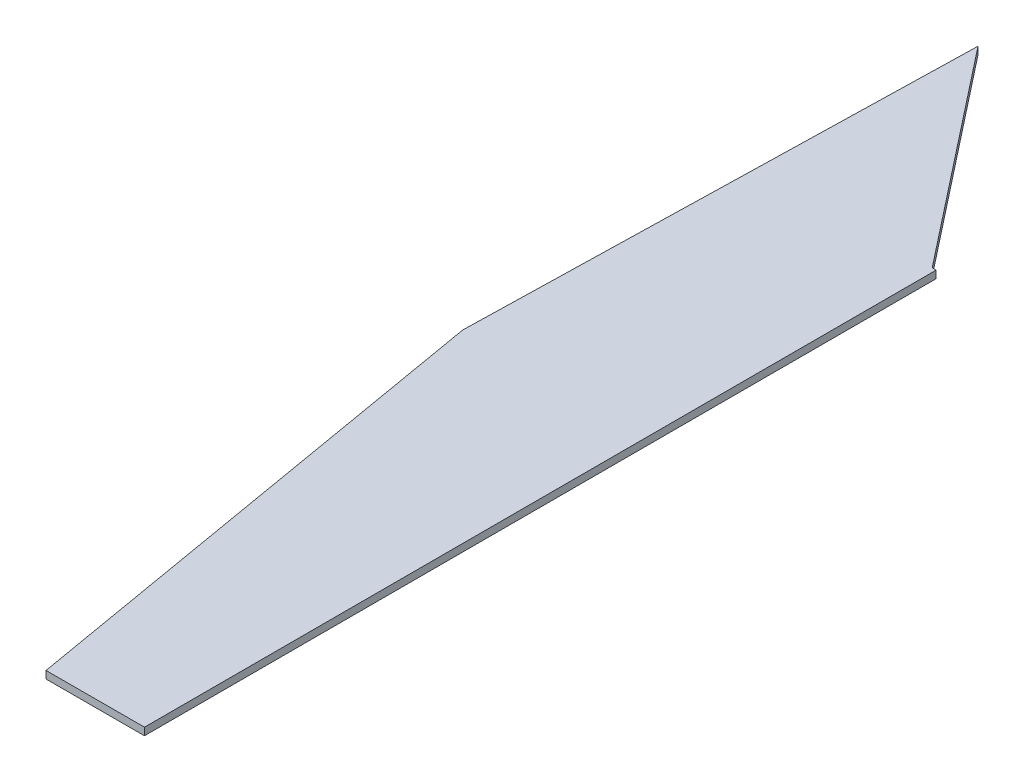
ISO-10303-21;
HEADER;
FILE_DESCRIPTION(('STEP AP214'),'2;1');
FILE_NAME('part.step','',(''),(''),'','','');
FILE_SCHEMA(('AUTOMOTIVE_DESIGN { 1 0 10303 214 1 1 1 1 }'));
ENDSEC;
DATA;
#1=APPLICATION_CONTEXT('core data for automotive mechanical design processes');
#2=APPLICATION_PROTOCOL_DEFINITION('international standard','automotive_design',2000,#1);
#3=PRODUCT_CONTEXT('',#1,'mechanical');
#4=PRODUCT('Part','Part','',(#3));
#5=PRODUCT_RELATED_PRODUCT_CATEGORY('part','',(#4));
#6=PRODUCT_DEFINITION_FORMATION('','',#4);
#7=PRODUCT_DEFINITION_CONTEXT('part definition',#1,'design');
#8=PRODUCT_DEFINITION('design','',#6,#7);
#9=PRODUCT_DEFINITION_SHAPE('','',#8);
#10=(LENGTH_UNIT() NAMED_UNIT(*) SI_UNIT(.MILLI.,.METRE.));
#11=(NAMED_UNIT(*) PLANE_ANGLE_UNIT() SI_UNIT($,.RADIAN.));
#12=(NAMED_UNIT(*) SI_UNIT($,.STERADIAN.) SOLID_ANGLE_UNIT());
#13=UNCERTAINTY_MEASURE_WITH_UNIT(LENGTH_MEASURE(1.E-05),#10,'distance_accuracy_value','');
#14=(GEOMETRIC_REPRESENTATION_CONTEXT(3) GLOBAL_UNCERTAINTY_ASSIGNED_CONTEXT((#13)) GLOBAL_UNIT_ASSIGNED_CONTEXT((#10,
#11,#12)) REPRESENTATION_CONTEXT('',''));
#15=CARTESIAN_POINT('',(0.,0.,0.));
#16=DIRECTION('',(0.,0.,1.));
#17=DIRECTION('',(1.,0.,0.));
#18=AXIS2_PLACEMENT_3D('',#15,#16,#17);
#19=CARTESIAN_POINT('',(-19.9944175208659,2.,-269.792172247349));
#20=DIRECTION('',(0.999721648592657,0.,0.0235929085782034));
#21=DIRECTION('',(0.0235929085782034,0.,-0.999721648592657));
#22=AXIS2_PLACEMENT_3D('',#19,#20,#21);
#23=PLANE('',#22);
#24=DIRECTION('',(-0.0235929085782034,0.,0.999721648592657));
#25=VECTOR('',#24,1.);
#26=CARTESIAN_POINT('',(-19.9944175208659,0.,-269.792172247349));
#27=LINE('',#26,#25);
#28=CARTESIAN_POINT('',(-19.9944175208659,0.,-269.792172247349));
#29=VERTEX_POINT('',#28);
#30=CARTESIAN_POINT('',(-23.1782743286374,0.,-134.879998693264));
#31=VERTEX_POINT('',#30);
#32=EDGE_CURVE('E128',#29,#31,#27,.T.);
#33=ORIENTED_EDGE('',*,*,#32,.T.);
#34=DIRECTION('',(0.,-1.,0.));
#35=VECTOR('',#34,1.);
#36=CARTESIAN_POINT('',(-23.1782743286374,2.,-134.879998693264));
#37=LINE('',#36,#35);
#38=CARTESIAN_POINT('',(-23.1782743286374,2.,-134.879998693264));
#39=VERTEX_POINT('',#38);
#40=EDGE_CURVE('E11',#39,#31,#37,.T.);
#41=ORIENTED_EDGE('',*,*,#40,.F.);
#42=DIRECTION('',(-0.0235929085782034,0.,0.999721648592657));
#43=VECTOR('',#42,1.);
#44=CARTESIAN_POINT('',(-19.9944175208659,2.,-269.792172247349));
#45=LINE('',#44,#43);
#46=CARTESIAN_POINT('',(-19.9944175208659,2.,-269.792172247349));
#47=VERTEX_POINT('',#46);
#48=EDGE_CURVE('E144',#47,#39,#45,.T.);
#49=ORIENTED_EDGE('',*,*,#48,.F.);
#50=DIRECTION('',(0.,-1.,0.));
#51=VECTOR('',#50,1.);
#52=CARTESIAN_POINT('',(-19.9944175208659,2.,-269.792172247349));
#53=LINE('',#52,#51);
#54=EDGE_CURVE('E124',#47,#29,#53,.T.);
#55=ORIENTED_EDGE('',*,*,#54,.T.);
#56=EDGE_LOOP('',(#33,#41,#49,#55));
#57=FACE_BOUND('',#56,.T.);
#58=ADVANCED_FACE('F39',(#57),#23,.F.);
#59=CARTESIAN_POINT('',(-23.1782743286374,2.,-134.879998693264));
#60=DIRECTION('',(0.985554044661549,0.,-0.169361226528572));
#61=DIRECTION('',(-0.169361226528572,0.,-0.985554044661549));
#62=AXIS2_PLACEMENT_3D('',#59,#60,#61);
#63=PLANE('',#62);
#64=DIRECTION('',(0.169361226528572,0.,0.985554044661549));
#65=VECTOR('',#64,1.);
#66=CARTESIAN_POINT('',(-23.1782743286374,0.,-134.879998693264));
#67=LINE('',#66,#65);
#68=CARTESIAN_POINT('',(0.,0.,0.));
#69=VERTEX_POINT('',#68);
#70=EDGE_CURVE('E132',#31,#69,#67,.T.);
#71=ORIENTED_EDGE('',*,*,#70,.T.);
#72=DIRECTION('',(0.,-1.,0.));
#73=VECTOR('',#72,1.);
#74=CARTESIAN_POINT('',(0.,2.,0.));
#75=LINE('',#74,#73);
#76=CARTESIAN_POINT('',(0.,2.,0.));
#77=VERTEX_POINT('',#76);
#78=EDGE_CURVE('E48',#77,#69,#75,.T.);
#79=ORIENTED_EDGE('',*,*,#78,.F.);
#80=DIRECTION('',(0.169361226528572,0.,0.985554044661549));
#81=VECTOR('',#80,1.);
#82=CARTESIAN_POINT('',(-23.1782743286374,2.,-134.879998693264));
#83=LINE('',#82,#81);
#84=EDGE_CURVE('E93',#39,#77,#83,.T.);
#85=ORIENTED_EDGE('',*,*,#84,.F.);
#86=ORIENTED_EDGE('',*,*,#40,.T.);
#87=EDGE_LOOP('',(#71,#79,#85,#86));
#88=FACE_BOUND('',#87,.T.);
#89=ADVANCED_FACE('F172',(#88),#63,.F.);
#90=CARTESIAN_POINT('',(0.,2.,0.));
#91=DIRECTION('',(-0.001220494530022,0.,-0.999999255196274));
#92=DIRECTION('',(-0.999999255196274,0.,0.001220494530022));
#93=AXIS2_PLACEMENT_3D('',#90,#91,#92);
#94=PLANE('',#93);
#95=DIRECTION('',(0.999999255196274,0.,-0.001220494530022));
#96=VECTOR('',#95,1.);
#97=CARTESIAN_POINT('',(0.,0.,0.));
#98=LINE('',#97,#96);
#99=CARTESIAN_POINT('',(26.3621311364079,0.,-0.0321748608156647));
#100=VERTEX_POINT('',#99);
#101=EDGE_CURVE('E135',#69,#100,#98,.T.);
#102=ORIENTED_EDGE('',*,*,#101,.T.);
#103=DIRECTION('',(0.,-1.,0.));
#104=VECTOR('',#103,1.);
#105=CARTESIAN_POINT('',(26.3621311364079,2.,-0.0321748608156647));
#106=LINE('',#105,#104);
#107=CARTESIAN_POINT('',(26.3621311364079,2.,-0.0321748608156647));
#108=VERTEX_POINT('',#107);
#109=EDGE_CURVE('E117',#108,#100,#106,.T.);
#110=ORIENTED_EDGE('',*,*,#109,.F.);
#111=DIRECTION('',(0.999999255196274,0.,-0.001220494530022));
#112=VECTOR('',#111,1.);
#113=CARTESIAN_POINT('',(0.,2.,0.));
#114=LINE('',#113,#112);
#115=EDGE_CURVE('E106',#77,#108,#114,.T.);
#116=ORIENTED_EDGE('',*,*,#115,.F.);
#117=ORIENTED_EDGE('',*,*,#78,.T.);
#118=EDGE_LOOP('',(#102,#110,#116,#117));
#119=FACE_BOUND('',#118,.T.);
#120=ADVANCED_FACE('F154',(#119),#94,.F.);
#121=CARTESIAN_POINT('',(26.3621311364079,2.,-0.0321748608156647));
#122=DIRECTION('',(-1.,0.,0.));
#123=DIRECTION('',(0.,0.,1.));
#124=AXIS2_PLACEMENT_3D('',#121,#122,#123);
#125=PLANE('',#124);
#126=DIRECTION('',(0.,0.,-1.));
#127=VECTOR('',#126,1.);
#128=CARTESIAN_POINT('',(26.3621311364079,0.,-0.0321748608156647));
#129=LINE('',#128,#127);
#130=CARTESIAN_POINT('',(26.3621311364079,0.,-212.216124508445));
#131=VERTEX_POINT('',#130);
#132=EDGE_CURVE('E115',#100,#131,#129,.T.);
#133=ORIENTED_EDGE('',*,*,#132,.T.);
#134=DIRECTION('',(0.,-1.,0.));
#135=VECTOR('',#134,1.);
#136=CARTESIAN_POINT('',(26.3621311364079,2.,-212.216124508445));
#137=LINE('',#136,#135);
#138=CARTESIAN_POINT('',(26.3621311364079,2.,-212.216124508445));
#139=VERTEX_POINT('',#138);
#140=EDGE_CURVE('E112',#139,#131,#137,.T.);
#141=ORIENTED_EDGE('',*,*,#140,.F.);
#142=DIRECTION('',(0.,0.,-1.));
#143=VECTOR('',#142,1.);
#144=CARTESIAN_POINT('',(26.3621311364079,2.,-0.0321748608156647));
#145=LINE('',#144,#143);
#146=EDGE_CURVE('E100',#108,#139,#145,.T.);
#147=ORIENTED_EDGE('',*,*,#146,.F.);
#148=ORIENTED_EDGE('',*,*,#109,.T.);
#149=EDGE_LOOP('',(#133,#141,#147,#148));
#150=FACE_BOUND('',#149,.T.);
#151=ADVANCED_FACE('F113',(#150),#125,.F.);
#152=CARTESIAN_POINT('',(26.3621311364079,2.,-212.216124508445));
#153=DIRECTION('',(-0.0235929085781299,0.,0.999721648592659));
#154=DIRECTION('',(0.999721648592659,0.,0.0235929085781299));
#155=AXIS2_PLACEMENT_3D('',#152,#153,#154);
#156=PLANE('',#155);
#157=DIRECTION('',(-0.999721648592659,0.,-0.0235929085781299));
#158=VECTOR('',#157,1.);
#159=CARTESIAN_POINT('',(26.3621311364079,0.,-212.216124508445));
#160=LINE('',#159,#158);
#161=CARTESIAN_POINT('',(25.2861533492979,0.,-212.24151702205));
#162=VERTEX_POINT('',#161);
#163=EDGE_CURVE('E79',#131,#162,#160,.T.);
#164=ORIENTED_EDGE('',*,*,#163,.T.);
#165=DIRECTION('',(0.,-1.,0.));
#166=VECTOR('',#165,1.);
#167=CARTESIAN_POINT('',(25.2861533492979,2.,-212.24151702205));
#168=LINE('',#167,#166);
#169=CARTESIAN_POINT('',(25.2861533492979,2.,-212.24151702205));
#170=VERTEX_POINT('',#169);
#171=EDGE_CURVE('E118',#170,#162,#168,.T.);
#172=ORIENTED_EDGE('',*,*,#171,.F.);
#173=DIRECTION('',(-0.999721648592659,0.,-0.0235929085781299));
#174=VECTOR('',#173,1.);
#175=CARTESIAN_POINT('',(26.3621311364079,2.,-212.216124508445));
#176=LINE('',#175,#174);
#177=EDGE_CURVE('E104',#139,#170,#176,.T.);
#178=ORIENTED_EDGE('',*,*,#177,.F.);
#179=ORIENTED_EDGE('',*,*,#140,.T.);
#180=EDGE_LOOP('',(#164,#172,#178,#179));
#181=FACE_BOUND('',#180,.T.);
#182=ADVANCED_FACE('F120',(#181),#156,.F.);
#183=CARTESIAN_POINT('',(25.2861533492979,2.,-212.24151702205));
#184=DIRECTION('',(-0.785905530133035,0.,0.618346583807425));
#185=DIRECTION('',(0.618346583807425,0.,0.785905530133035));
#186=AXIS2_PLACEMENT_3D('',#183,#184,#185);
#187=PLANE('',#186);
#188=DIRECTION('',(-0.618346583807425,0.,-0.785905530133035));
#189=VECTOR('',#188,1.);
#190=CARTESIAN_POINT('',(25.2861533492979,0.,-212.24151702205));
#191=LINE('',#190,#189);
#192=EDGE_CURVE('E85',#162,#29,#191,.T.);
#193=ORIENTED_EDGE('',*,*,#192,.T.);
#194=ORIENTED_EDGE('',*,*,#54,.F.);
#195=DIRECTION('',(-0.618346583807425,0.,-0.785905530133035));
#196=VECTOR('',#195,1.);
#197=CARTESIAN_POINT('',(25.2861533492979,2.,-212.24151702205));
#198=LINE('',#197,#196);
#199=EDGE_CURVE('E56',#170,#47,#198,.T.);
#200=ORIENTED_EDGE('',*,*,#199,.F.);
#201=ORIENTED_EDGE('',*,*,#171,.T.);
#202=EDGE_LOOP('',(#193,#194,#200,#201));
#203=FACE_BOUND('',#202,.T.);
#204=ADVANCED_FACE('F161',(#203),#187,.F.);
#205=CARTESIAN_POINT('',(0.,2.,0.));
#206=DIRECTION('',(0.,-1.,0.));
#207=DIRECTION('',(0.,0.,-1.));
#208=AXIS2_PLACEMENT_3D('',#205,#206,#207);
#209=PLANE('',#208);
#210=ORIENTED_EDGE('',*,*,#48,.T.);
#211=ORIENTED_EDGE('',*,*,#84,.T.);
#212=ORIENTED_EDGE('',*,*,#115,.T.);
#213=ORIENTED_EDGE('',*,*,#146,.T.);
#214=ORIENTED_EDGE('',*,*,#177,.T.);
#215=ORIENTED_EDGE('',*,*,#199,.T.);
#216=EDGE_LOOP('',(#210,#211,#212,#213,#214,#215));
#217=FACE_BOUND('',#216,.T.);
#218=ADVANCED_FACE('F102',(#217),#209,.F.);
#219=CARTESIAN_POINT('',(0.,0.,0.));
#220=DIRECTION('',(0.,-1.,0.));
#221=DIRECTION('',(0.,0.,-1.));
#222=AXIS2_PLACEMENT_3D('',#219,#220,#221);
#223=PLANE('',#222);
#224=ORIENTED_EDGE('',*,*,#32,.F.);
#225=ORIENTED_EDGE('',*,*,#192,.F.);
#226=ORIENTED_EDGE('',*,*,#163,.F.);
#227=ORIENTED_EDGE('',*,*,#132,.F.);
#228=ORIENTED_EDGE('',*,*,#101,.F.);
#229=ORIENTED_EDGE('',*,*,#70,.F.);
#230=EDGE_LOOP('',(#224,#225,#226,#227,#228,#229));
#231=FACE_BOUND('',#230,.T.);
#232=ADVANCED_FACE('F157',(#231),#223,.T.);
#233=CLOSED_SHELL('',(#58,#89,#120,#151,#182,#204,#218,#232));
#234=MANIFOLD_SOLID_BREP('B2',#233);
#235=ADVANCED_BREP_SHAPE_REPRESENTATION('',(#18,#234),#14);
#236=SHAPE_DEFINITION_REPRESENTATION(#9,#235);
ENDSEC;
END-ISO-10303-21;
